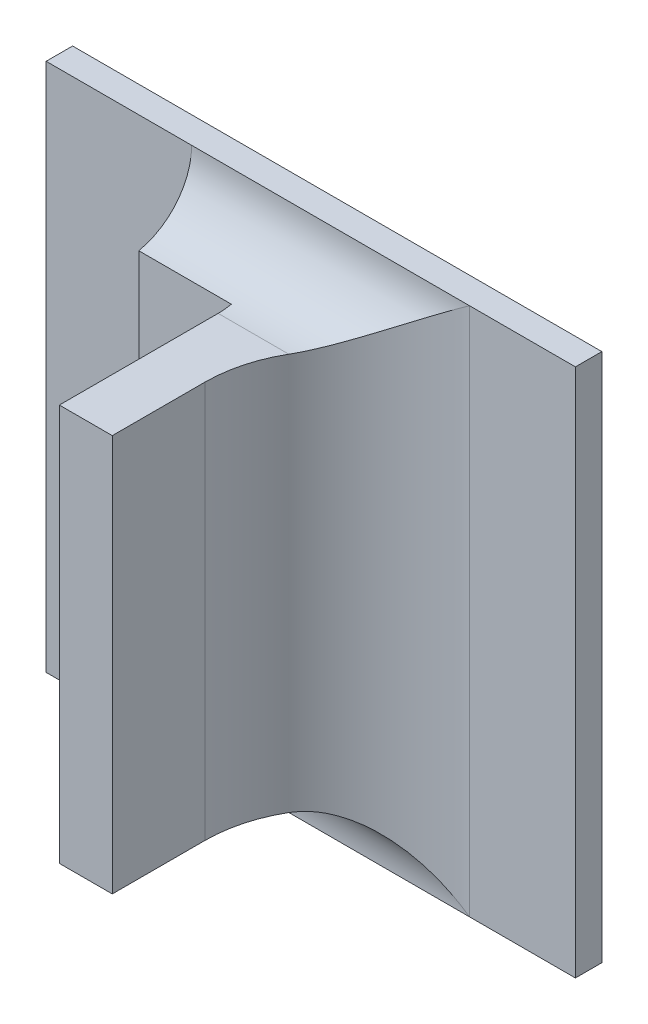
ISO-10303-21;
HEADER;
FILE_DESCRIPTION(('STEP AP214'),'2;1');
FILE_NAME('part.step','',(''),(''),'','','');
FILE_SCHEMA(('AUTOMOTIVE_DESIGN { 1 0 10303 214 1 1 1 1 }'));
ENDSEC;
DATA;
#1=APPLICATION_CONTEXT('core data for automotive mechanical design processes');
#2=APPLICATION_PROTOCOL_DEFINITION('international standard','automotive_design',2000,#1);
#3=PRODUCT_CONTEXT('',#1,'mechanical');
#4=PRODUCT('Part','Part','',(#3));
#5=PRODUCT_RELATED_PRODUCT_CATEGORY('part','',(#4));
#6=PRODUCT_DEFINITION_FORMATION('','',#4);
#7=PRODUCT_DEFINITION_CONTEXT('part definition',#1,'design');
#8=PRODUCT_DEFINITION('design','',#6,#7);
#9=PRODUCT_DEFINITION_SHAPE('','',#8);
#10=(LENGTH_UNIT() NAMED_UNIT(*) SI_UNIT(.MILLI.,.METRE.));
#11=(NAMED_UNIT(*) PLANE_ANGLE_UNIT() SI_UNIT($,.RADIAN.));
#12=(NAMED_UNIT(*) SI_UNIT($,.STERADIAN.) SOLID_ANGLE_UNIT());
#13=UNCERTAINTY_MEASURE_WITH_UNIT(LENGTH_MEASURE(1.E-05),#10,'distance_accuracy_value','');
#14=(GEOMETRIC_REPRESENTATION_CONTEXT(3) GLOBAL_UNCERTAINTY_ASSIGNED_CONTEXT((#13)) GLOBAL_UNIT_ASSIGNED_CONTEXT((#10,
#11,#12)) REPRESENTATION_CONTEXT('',''));
#15=CARTESIAN_POINT('',(0.,0.,0.));
#16=DIRECTION('',(0.,0.,1.));
#17=DIRECTION('',(1.,0.,0.));
#18=AXIS2_PLACEMENT_3D('',#15,#16,#17);
#19=CARTESIAN_POINT('',(0.425658549336287,-0.311549667580545,0.0796271653543306));
#20=DIRECTION('',(-1.,0.,0.));
#21=DIRECTION('',(0.,-1.,0.));
#22=AXIS2_PLACEMENT_3D('',#19,#20,#21);
#23=PLANE('',#22);
#24=DIRECTION('',(0.,-1.,0.));
#25=VECTOR('',#24,1.);
#26=CARTESIAN_POINT('',(0.425658549336287,-0.360053604588419,0.0800681102362204));
#27=LINE('',#26,#25);
#28=CARTESIAN_POINT('',(0.425658549336287,-0.351234706950624,0.0800681102362204));
#29=VERTEX_POINT('',#28);
#30=CARTESIAN_POINT('',(0.425658549336287,-0.313439431360073,0.0800681102362204));
#31=VERTEX_POINT('',#30);
#32=EDGE_CURVE('E116',#29,#31,#27,.F.);
#33=ORIENTED_EDGE('',*,*,#32,.T.);
#34=DIRECTION('',(0.,0.,1.));
#35=VECTOR('',#34,1.);
#36=CARTESIAN_POINT('',(0.425658549336287,-0.313439431360073,0.0730129921259841));
#37=LINE('',#36,#35);
#38=CARTESIAN_POINT('',(0.425658549336287,-0.313439431360073,0.0888870078740156));
#39=VERTEX_POINT('',#38);
#40=EDGE_CURVE('E294',#39,#31,#37,.F.);
#41=ORIENTED_EDGE('',*,*,#40,.F.);
#42=DIRECTION('',(0.,1.,0.));
#43=VECTOR('',#42,1.);
#44=CARTESIAN_POINT('',(0.425658549336287,-0.311549667580545,0.0888870078740156));
#45=LINE('',#44,#43);
#46=CARTESIAN_POINT('',(0.425658549336287,-0.351234706950624,0.0888870078740156));
#47=VERTEX_POINT('',#46);
#48=EDGE_CURVE('E306',#39,#47,#45,.F.);
#49=ORIENTED_EDGE('',*,*,#48,.T.);
#50=DIRECTION('',(0.,0.,1.));
#51=VECTOR('',#50,1.);
#52=CARTESIAN_POINT('',(0.425658549336287,-0.351234706950624,0.0730129921259841));
#53=LINE('',#52,#51);
#54=EDGE_CURVE('E305',#47,#29,#53,.F.);
#55=ORIENTED_EDGE('',*,*,#54,.T.);
#56=EDGE_LOOP('',(#33,#41,#49,#55));
#57=FACE_BOUND('',#56,.T.);
#58=ADVANCED_FACE('F17',(#57),#23,.F.);
#59=CARTESIAN_POINT('',(0.420367210753609,-0.311549667580545,0.0888870078740156));
#60=DIRECTION('',(0.,0.,-1.));
#61=DIRECTION('',(-1.,0.,0.));
#62=AXIS2_PLACEMENT_3D('',#59,#60,#61);
#63=PLANE('',#62);
#64=DIRECTION('',(0.,1.,0.));
#65=VECTOR('',#64,1.);
#66=CARTESIAN_POINT('',(0.420619179257546,-0.35326446766354,0.0888870078740156));
#67=LINE('',#66,#65);
#68=CARTESIAN_POINT('',(0.420619179257546,-0.313439431360073,0.0888870078740156));
#69=VERTEX_POINT('',#68);
#70=CARTESIAN_POINT('',(0.420619179257546,-0.351234706950624,0.0888870078740156));
#71=VERTEX_POINT('',#70);
#72=EDGE_CURVE('E297',#69,#71,#67,.F.);
#73=ORIENTED_EDGE('',*,*,#72,.T.);
#74=DIRECTION('',(-1.,0.,0.));
#75=VECTOR('',#74,1.);
#76=CARTESIAN_POINT('',(0.427682780215358,-0.351234706950624,0.0888870078740156));
#77=LINE('',#76,#75);
#78=EDGE_CURVE('E302',#71,#47,#77,.F.);
#79=ORIENTED_EDGE('',*,*,#78,.T.);
#80=ORIENTED_EDGE('',*,*,#48,.F.);
#81=DIRECTION('',(-1.,0.,0.));
#82=VECTOR('',#81,1.);
#83=CARTESIAN_POINT('',(0.427682780215358,-0.313439431360073,0.0888870078740156));
#84=LINE('',#83,#82);
#85=EDGE_CURVE('E291',#69,#39,#84,.F.);
#86=ORIENTED_EDGE('',*,*,#85,.F.);
#87=EDGE_LOOP('',(#73,#79,#80,#86));
#88=FACE_BOUND('',#87,.T.);
#89=ADVANCED_FACE('F321',(#88),#63,.F.);
#90=CARTESIAN_POINT('',(0.427682780215358,-0.351234706950624,0.0730129921259841));
#91=DIRECTION('',(0.,1.,0.));
#92=DIRECTION('',(-1.,0.,0.));
#93=AXIS2_PLACEMENT_3D('',#90,#91,#92);
#94=PLANE('',#93);
#95=DIRECTION('',(-1.,0.,0.));
#96=VECTOR('',#95,1.);
#97=CARTESIAN_POINT('',(0.385343588706365,-0.351234706950624,0.0737688976377952));
#98=LINE('',#97,#96);
#99=CARTESIAN_POINT('',(0.420619179257546,-0.351234706950624,0.0737688976377952));
#100=VERTEX_POINT('',#99);
#101=CARTESIAN_POINT('',(0.427346418264987,-0.351234706950624,0.0737688976377951));
#102=VERTEX_POINT('',#101);
#103=EDGE_CURVE('E127',#100,#102,#98,.F.);
#104=ORIENTED_EDGE('',*,*,#103,.T.);
#105=CARTESIAN_POINT('',(0.438256974533137,-0.351234706950624,0.0800681102362204));
#106=DIRECTION('',(0.,-1.,0.));
#107=DIRECTION('',(1.,0.,0.));
#108=AXIS2_PLACEMENT_3D('',#105,#106,#107);
#109=CIRCLE('',#108,0.0125984251968504);
#110=EDGE_CURVE('E20',#102,#29,#109,.F.);
#111=ORIENTED_EDGE('',*,*,#110,.T.);
#112=ORIENTED_EDGE('',*,*,#54,.F.);
#113=ORIENTED_EDGE('',*,*,#78,.F.);
#114=DIRECTION('',(0.,0.,1.));
#115=VECTOR('',#114,1.);
#116=CARTESIAN_POINT('',(0.420619179257546,-0.351234706950624,0.0716901574803148));
#117=LINE('',#116,#115);
#118=EDGE_CURVE('E135',#71,#100,#117,.F.);
#119=ORIENTED_EDGE('',*,*,#118,.T.);
#120=EDGE_LOOP('',(#104,#111,#112,#113,#119));
#121=FACE_BOUND('',#120,.T.);
#122=ADVANCED_FACE('F133',(#121),#94,.F.);
#123=CARTESIAN_POINT('',(0.411359336737861,-0.311409670647157,0.0725090551181101));
#124=DIRECTION('',(0.,0.,-1.));
#125=DIRECTION('',(-1.,0.,0.));
#126=AXIS2_PLACEMENT_3D('',#123,#124,#125);
#127=PLANE('',#126);
#128=DIRECTION('',(1.,0.,0.));
#129=VECTOR('',#128,1.);
#130=CARTESIAN_POINT('',(0.439579809178806,-0.313312161420629,0.0725090551181101));
#131=LINE('',#130,#129);
#132=CARTESIAN_POINT('',(0.420619179257546,-0.313312161420629,0.0725090551181101));
#133=VERTEX_POINT('',#132);
#134=CARTESIAN_POINT('',(0.411800281619751,-0.313312161420629,0.0725090551181101));
#135=VERTEX_POINT('',#134);
#136=EDGE_CURVE('E142',#133,#135,#131,.F.);
#137=ORIENTED_EDGE('',*,*,#136,.T.);
#138=DIRECTION('',(0.,1.,0.));
#139=VECTOR('',#138,1.);
#140=CARTESIAN_POINT('',(0.411800281619751,-0.304620533722278,0.0725090551181101));
#141=LINE('',#140,#139);
#142=CARTESIAN_POINT('',(0.411800281619751,-0.351361976890068,0.0725090551181101));
#143=VERTEX_POINT('',#142);
#144=EDGE_CURVE('E146',#135,#143,#141,.F.);
#145=ORIENTED_EDGE('',*,*,#144,.T.);
#146=DIRECTION('',(-1.,0.,0.));
#147=VECTOR('',#146,1.);
#148=CARTESIAN_POINT('',(0.385343588706365,-0.351361976890068,0.0725090551181101));
#149=LINE('',#148,#147);
#150=CARTESIAN_POINT('',(0.420619179257546,-0.351361976890068,0.0725090551181101));
#151=VERTEX_POINT('',#150);
#152=EDGE_CURVE('E138',#143,#151,#149,.F.);
#153=ORIENTED_EDGE('',*,*,#152,.T.);
#154=DIRECTION('',(0.,1.,0.));
#155=VECTOR('',#154,1.);
#156=CARTESIAN_POINT('',(0.420619179257546,-0.35326446766354,0.0725090551181101));
#157=LINE('',#156,#155);
#158=EDGE_CURVE('E324',#151,#133,#157,.T.);
#159=ORIENTED_EDGE('',*,*,#158,.T.);
#160=EDGE_LOOP('',(#137,#145,#153,#159));
#161=FACE_BOUND('',#160,.T.);
#162=ADVANCED_FACE('F193',(#161),#127,.F.);
#163=CARTESIAN_POINT('',(0.438256974533137,-0.360053604588419,0.0800681102362204));
#164=DIRECTION('',(0.,-1.,0.));
#165=DIRECTION('',(1.,0.,0.));
#166=AXIS2_PLACEMENT_3D('',#163,#164,#165);
#167=CYLINDRICAL_SURFACE('',#166,0.0125984251968504);
#168=CARTESIAN_POINT('',(0.427346418264987,-0.351234706950624,0.073768897637795));
#169=CARTESIAN_POINT('',(0.427618902769467,-0.351235264602844,0.0732955457546591));
#170=CARTESIAN_POINT('',(0.42792101489507,-0.351287791933283,0.0728445682080297));
#171=CARTESIAN_POINT('',(0.428566482669071,-0.351472774611581,0.0720003898002664));
#172=CARTESIAN_POINT('',(0.428909215144327,-0.351604122731851,0.0716064807283955));
#173=CARTESIAN_POINT('',(0.429694452269101,-0.351954482138244,0.0708064921171964));
#174=CARTESIAN_POINT('',(0.430143523397404,-0.352185429374069,0.0704123993317733));
#175=CARTESIAN_POINT('',(0.431073449659003,-0.352703528005895,0.0697017381084181));
#176=CARTESIAN_POINT('',(0.431554482929699,-0.352991015612919,0.0693856602556568));
#177=CARTESIAN_POINT('',(0.432735220374202,-0.353727172372372,0.0687164538298325));
#178=CARTESIAN_POINT('',(0.433444497485564,-0.354193928271791,0.0684002761150404));
#179=CARTESIAN_POINT('',(0.434881525200421,-0.355165489292896,0.0679065689436589));
#180=CARTESIAN_POINT('',(0.435609243960198,-0.355670231444697,0.0677288153407497));
#181=CARTESIAN_POINT('',(0.436785206529677,-0.356494415867953,0.0675478835698786));
#182=CARTESIAN_POINT('',(0.437231061313947,-0.356808848945618,0.0675035718032502));
#183=CARTESIAN_POINT('',(0.437870482358516,-0.357260628255393,0.0674741343290926));
#184=CARTESIAN_POINT('',(0.438063733008177,-0.357397277676518,0.0674696949622004));
#185=CARTESIAN_POINT('',(0.438256974533137,-0.357533919549049,0.06746968503937));
#186=B_SPLINE_CURVE_WITH_KNOTS('',3,(#168,#169,#170,#171,#172,#173,#174,#175,#176,#177,#178,
#179,#180,#181,#182,#183,#184,#185),.UNSPECIFIED.,.F.,.F.,(4,2,2,2,2,2,2,2,4),(0.,
0.00162828046163537,0.00323420635682064,0.00514617952943926,0.00706988591555798,
0.00977367423346231,0.012473075225337,0.0141132082090726,0.0148232188039429),.UNSPECIFIED.);
#187=CARTESIAN_POINT('',(0.438256974533137,-0.357533919549049,0.06746968503937));
#188=VERTEX_POINT('',#187);
#189=EDGE_CURVE('E113',#102,#188,#186,.T.);
#190=ORIENTED_EDGE('',*,*,#189,.T.);
#191=DIRECTION('',(0.,1.,0.));
#192=VECTOR('',#191,1.);
#193=CARTESIAN_POINT('',(0.438256974533137,-0.304620533722278,0.06746968503937));
#194=LINE('',#193,#192);
#195=CARTESIAN_POINT('',(0.438256974533137,-0.307140218761648,0.06746968503937));
#196=VERTEX_POINT('',#195);
#197=EDGE_CURVE('E279',#196,#188,#194,.F.);
#198=ORIENTED_EDGE('',*,*,#197,.F.);
#199=CARTESIAN_POINT('',(0.438256974533137,-0.307140218761648,0.06746968503937));
#200=CARTESIAN_POINT('',(0.438256974438822,-0.307140317600168,0.0674696850393615));
#201=CARTESIAN_POINT('',(0.438256964288311,-0.307140416428939,0.0674696850424135));
#202=CARTESIAN_POINT('',(0.438256928445353,-0.307140611354748,0.0674696850532617));
#203=CARTESIAN_POINT('',(0.438256902687308,-0.307140707438454,0.0674696850610781));
#204=CARTESIAN_POINT('',(0.438256838765286,-0.307140897584729,0.0674696850805151));
#205=CARTESIAN_POINT('',(0.438256800347705,-0.30714099156009,0.0674696850922136));
#206=CARTESIAN_POINT('',(0.438256714098717,-0.307141174837888,0.0674696851185221));
#207=CARTESIAN_POINT('',(0.438256666277362,-0.307141264145186,0.067469685133129));
#208=CARTESIAN_POINT('',(0.438256503866366,-0.307141540902339,0.0674696851828237));
#209=CARTESIAN_POINT('',(0.438256376605556,-0.307141720962886,0.0674696852218837));
#210=CARTESIAN_POINT('',(0.438256101772834,-0.307142061590547,0.0674696853066755));
#211=CARTESIAN_POINT('',(0.438255954365684,-0.307142222297702,0.0674696853523532));
#212=CARTESIAN_POINT('',(0.438255427125546,-0.30714275975848,0.0674696855167746));
#213=CARTESIAN_POINT('',(0.438255020933897,-0.307143110950677,0.0674696856452023));
#214=CARTESIAN_POINT('',(0.438254180977937,-0.307143742641604,0.0674696859163221));
#215=CARTESIAN_POINT('',(0.438253748656656,-0.307144025168177,0.0674696860583659));
#216=CARTESIAN_POINT('',(0.438252070479869,-0.307145088805981,0.0674696866214032));
#217=CARTESIAN_POINT('',(0.438250797887275,-0.307145826268706,0.0674696870727233));
#218=CARTESIAN_POINT('',(0.43824832352845,-0.307147133962223,0.0674696882497374));
#219=CARTESIAN_POINT('',(0.438247126754368,-0.307147713460052,0.0674696889448008));
#220=CARTESIAN_POINT('',(0.438239266918325,-0.307151849249196,0.0674696947394657));
#221=CARTESIAN_POINT('',(0.438233316357029,-0.307156609323055,0.067469705198469));
#222=CARTESIAN_POINT('',(0.43821123423804,-0.307173483152928,0.0674697594501571));
#223=CARTESIAN_POINT('',(0.438194589490827,-0.307184696077487,0.0674698297573796));
#224=CARTESIAN_POINT('',(0.438133821746473,-0.307226386954018,0.0674702062030112));
#225=CARTESIAN_POINT('',(0.438090216208394,-0.307257775090299,0.0674707100991553));
#226=CARTESIAN_POINT('',(0.437923848618546,-0.307376764604737,0.0674735003948733));
#227=CARTESIAN_POINT('',(0.437800556430686,-0.307463363679941,0.0674773623702134));
#228=CARTESIAN_POINT('',(0.436760521775255,-0.308194415116372,0.0675251688134003));
#229=CARTESIAN_POINT('',(0.435845966110576,-0.308840824556344,0.0676670910917156));
#230=CARTESIAN_POINT('',(0.434182625513507,-0.309985925569803,0.0681207439021359));
#231=CARTESIAN_POINT('',(0.433430458958543,-0.310491829145844,0.0684021380812103));
#232=CARTESIAN_POINT('',(0.432200546582992,-0.311283401329248,0.069007145077635));
#233=CARTESIAN_POINT('',(0.431713131050863,-0.311587175065945,0.0692872417521839));
#234=CARTESIAN_POINT('',(0.430746062270782,-0.312158547189347,0.0699361732585048));
#235=CARTESIAN_POINT('',(0.430267221251112,-0.312424585539931,0.0703076754457104));
#236=CARTESIAN_POINT('',(0.429469212762975,-0.312823166861075,0.071029025049874));
#237=CARTESIAN_POINT('',(0.429140885650844,-0.31297243520059,0.0713594163896828));
#238=CARTESIAN_POINT('',(0.428516810434649,-0.313215602302386,0.0720638443645076));
#239=CARTESIAN_POINT('',(0.428220814609918,-0.313309950219131,0.0724374961036004));
#240=CARTESIAN_POINT('',(0.427727016994763,-0.313415914374917,0.073141038661769));
#241=CARTESIAN_POINT('',(0.427521660454619,-0.31344076414939,0.0734635869359735));
#242=CARTESIAN_POINT('',(0.427141035293349,-0.313437989894047,0.0741265585439533));
#243=CARTESIAN_POINT('',(0.426965788006156,-0.31341032882348,0.0744669943307327));
#244=CARTESIAN_POINT('',(0.42664914342728,-0.313294679389271,0.0751565544091365));
#245=CARTESIAN_POINT('',(0.426507984609139,-0.313206281764493,0.0755057220621309));
#246=CARTESIAN_POINT('',(0.426263178152904,-0.312965001062621,0.0761947785868875));
#247=CARTESIAN_POINT('',(0.42615950288724,-0.312812165660658,0.0765346741211982));
#248=CARTESIAN_POINT('',(0.425997799174617,-0.312466071945115,0.0771489075153617));
#249=CARTESIAN_POINT('',(0.425935780344855,-0.312279886373216,0.0774262133810268));
#250=CARTESIAN_POINT('',(0.425834972776401,-0.311863410254162,0.0779502251276348));
#251=CARTESIAN_POINT('',(0.42579618395166,-0.311633119870385,0.0781969311219236));
#252=CARTESIAN_POINT('',(0.425736914380721,-0.311139310998908,0.0786471201676947));
#253=CARTESIAN_POINT('',(0.425716118637251,-0.310876460373297,0.078851297275294));
#254=CARTESIAN_POINT('',(0.425686068802665,-0.310321433419959,0.0792159384509799));
#255=CARTESIAN_POINT('',(0.425676816285678,-0.310029253098465,0.0793763965548561));
#256=CARTESIAN_POINT('',(0.425664518241791,-0.309410568564247,0.0796549300095399));
#257=CARTESIAN_POINT('',(0.42566174556578,-0.309083144094315,0.0797709755115423));
#258=CARTESIAN_POINT('',(0.425658812024396,-0.308413669505017,0.0799477574285475));
#259=CARTESIAN_POINT('',(0.42565865145093,-0.308071617755308,0.0800084876612566));
#260=CARTESIAN_POINT('',(0.425658505130257,-0.307374847298271,0.0800736589499428));
#261=CARTESIAN_POINT('',(0.425658523160028,-0.307020013767971,0.0800768798691539));
#262=CARTESIAN_POINT('',(0.425658600569965,-0.306314811859268,0.0800238026376847));
#263=CARTESIAN_POINT('',(0.425658659952903,-0.305964443781737,0.0799675004977201));
#264=CARTESIAN_POINT('',(0.425661183454692,-0.305277507288452,0.0797968199531621));
#265=CARTESIAN_POINT('',(0.425663651714602,-0.304940963676405,0.0796823417014521));
#266=CARTESIAN_POINT('',(0.425675557720901,-0.30429193671443,0.0793985331604369));
#267=CARTESIAN_POINT('',(0.425684995718328,-0.303979454231589,0.0792292008955119));
#268=CARTESIAN_POINT('',(0.425716866101117,-0.303389548026495,0.0788419881994158));
#269=CARTESIAN_POINT('',(0.425739219685528,-0.303111924019511,0.078624407062953));
#270=CARTESIAN_POINT('',(0.425803507677939,-0.302598008180998,0.0781473882147604));
#271=CARTESIAN_POINT('',(0.425845434614652,-0.30236170062595,0.0778879664985857));
#272=CARTESIAN_POINT('',(0.425953027178495,-0.301944772977547,0.0773466142760765));
#273=CARTESIAN_POINT('',(0.426017814639718,-0.301762499248574,0.0770657832005054));
#274=CARTESIAN_POINT('',(0.426175076067539,-0.301447086827108,0.0764850450664437));
#275=CARTESIAN_POINT('',(0.42626754153052,-0.301313933071312,0.0761851438891879));
#276=CARTESIAN_POINT('',(0.426478461134743,-0.301100802250232,0.0755865038391837));
#277=CARTESIAN_POINT('',(0.42659610402998,-0.301019424424718,0.075287973128724));
#278=CARTESIAN_POINT('',(0.42685781902439,-0.300901879920434,0.0746936193238615));
#279=CARTESIAN_POINT('',(0.427001904997203,-0.300865737052864,0.0743977977367695));
#280=CARTESIAN_POINT('',(0.427324014993842,-0.300833457265666,0.0737980252798641));
#281=CARTESIAN_POINT('',(0.427503635767308,-0.300840072083108,0.0734947949351432));
#282=CARTESIAN_POINT('',(0.427885466549418,-0.300893220663338,0.0729074487273722));
#283=CARTESIAN_POINT('',(0.428087655394361,-0.300939717295166,0.0726233153498298));
#284=CARTESIAN_POINT('',(0.428622364090683,-0.301099160254376,0.0719334846819081));
#285=CARTESIAN_POINT('',(0.428967440682686,-0.301234206619572,0.0715425793781451));
#286=CARTESIAN_POINT('',(0.429692118241114,-0.30156235973977,0.0708143812686401));
#287=CARTESIAN_POINT('',(0.430072057118797,-0.301756088608605,0.0704777252629505));
#288=CARTESIAN_POINT('',(0.431026722998603,-0.302279339643324,0.0697260645086062));
#289=CARTESIAN_POINT('',(0.431613503812273,-0.302631080843893,0.0693419139325726));
#290=CARTESIAN_POINT('',(0.432788385858753,-0.303370485460523,0.0686995101782901));
#291=CARTESIAN_POINT('',(0.433375398593854,-0.303756022313255,0.0684366507296655));
#292=CARTESIAN_POINT('',(0.434524288565559,-0.304528568289244,0.0680209366897774));
#293=CARTESIAN_POINT('',(0.435085209036768,-0.304913742395932,0.0678618837368312));
#294=CARTESIAN_POINT('',(0.436321603106594,-0.305774456157341,0.0676002423539604));
#295=CARTESIAN_POINT('',(0.436998493798785,-0.306253204314874,0.0675142406050075));
#296=CARTESIAN_POINT('',(0.437800034589787,-0.306816723517622,0.0674773844657497));
#297=CARTESIAN_POINT('',(0.43792282744822,-0.306902958808099,0.0674735321464732));
#298=CARTESIAN_POINT('',(0.43808904884134,-0.307021838644933,0.0674707243957126));
#299=CARTESIAN_POINT('',(0.43813300992244,-0.307053485081974,0.0674702128513251));
#300=CARTESIAN_POINT('',(0.438194255542905,-0.307095501849072,0.0674698312735403));
#301=CARTESIAN_POINT('',(0.438211017064816,-0.307106792621677,0.0674697601164234));
#302=CARTESIAN_POINT('',(0.438233237836947,-0.307123774563247,0.0674697053274289));
#303=CARTESIAN_POINT('',(0.438239214791401,-0.307128556132832,0.0674696947878421));
#304=CARTESIAN_POINT('',(0.438247108811657,-0.307132705901441,0.0674696889590613));
#305=CARTESIAN_POINT('',(0.438248308763518,-0.307133286333551,0.0674696882612312));
#306=CARTESIAN_POINT('',(0.438250789596883,-0.307134597075485,0.0674696870796236));
#307=CARTESIAN_POINT('',(0.438252065424562,-0.307135336773202,0.0674696866266876));
#308=CARTESIAN_POINT('',(0.438253747260274,-0.307136403621154,0.0674696860616838));
#309=CARTESIAN_POINT('',(0.438254180219584,-0.307136686826689,0.0674696859192267));
#310=CARTESIAN_POINT('',(0.438255021293022,-0.307137320138761,0.0674696856472792));
#311=CARTESIAN_POINT('',(0.438255427954509,-0.307137672284289,0.0674696855184389));
#312=CARTESIAN_POINT('',(0.43825595560389,-0.30713821114919,0.0674696853534853));
#313=CARTESIAN_POINT('',(0.43825610307399,-0.307138372237131,0.067469685307667));
#314=CARTESIAN_POINT('',(0.438256377953441,-0.307138713663398,0.0674696852226042));
#315=CARTESIAN_POINT('',(0.438256505197113,-0.30713889414225,0.0674696851834138));
#316=CARTESIAN_POINT('',(0.438256667493891,-0.307139171508259,0.0674696851335454));
#317=CARTESIAN_POINT('',(0.438256715263801,-0.307139261001292,0.067469685118887));
#318=CARTESIAN_POINT('',(0.438256801379348,-0.30713944464998,0.0674696850924812));
#319=CARTESIAN_POINT('',(0.438256839714873,-0.307139538810509,0.067469685080737));
#320=CARTESIAN_POINT('',(0.438256903435913,-0.307139729312035,0.067469685061218));
#321=CARTESIAN_POINT('',(0.438256929076262,-0.307139825565832,0.0674696850533652));
#322=CARTESIAN_POINT('',(0.438256964639104,-0.307140020812425,0.0674696850424555));
#323=CARTESIAN_POINT('',(0.438256974627577,-0.307140119791924,0.0674696850393785));
#324=CARTESIAN_POINT('',(0.438256974533137,-0.307140218761648,0.06746968503937));
#325=B_SPLINE_CURVE_WITH_KNOTS('',3,(#199,#200,#201,#202,#203,#204,#205,#206,#207,#208,#209,
#210,#211,#212,#213,#214,#215,#216,#217,#218,#219,#220,#221,#222,#223,#224,#225,#226,#227,#228,
#229,#230,#231,#232,#233,#234,#235,#236,#237,#238,#239,#240,#241,#242,#243,#244,#245,#246,#247,
#248,#249,#250,#251,#252,#253,#254,#255,#256,#257,#258,#259,#260,#261,#262,#263,#264,#265,#266,
#267,#268,#269,#270,#271,#272,#273,#274,#275,#276,#277,#278,#279,#280,#281,#282,#283,#284,#285,
#286,#287,#288,#289,#290,#291,#292,#293,#294,#295,#296,#297,#298,#299,#300,#301,#302,#303,#304,
#305,#306,#307,#308,#309,#310,#311,#312,#313,#314,#315,#316,#317,#318,#319,#320,#321,#322,#323,
#324),.UNSPECIFIED.,.T.,.F.,(4,2,2,2,2,2,2,2,2,2,2,2,2,2,2,2,2,2,2,2,2,2,2,2,2,2,2,2,2,2,2,2,2,
2,2,2,2,2,2,2,2,2,2,2,2,2,2,2,2,2,2,2,2,2,2,2,2,2,2,2,2,2,4),(0.,2.96262718477316E-07,
5.93779356058444E-07,8.97660571573596E-07,1.20121869984068E-06,1.85983939929508E-06,
2.51336440040741E-06,4.11695718381811E-06,5.6649867523353E-06,1.00742722995031E-05,
1.40586629767685E-05,3.67471450073604E-05,9.70745534321224E-05,0.000258117828158611,
0.000710418104869183,0.00407475533961822,0.00690809627288586,0.00881968522125092,
0.0107955574621808,0.0122580167053817,0.0137083411294308,0.0148534027078703,0.0159992723041917,
0.017152939826701,0.0183057552869513,0.0193199166517909,0.0203340742599355,0.0213300957694083,
0.0223262530896368,0.0233636546164694,0.0244011720739371,0.0254606762934847,0.0265202515263764,
0.0275816514712125,0.0286430896476358,0.0296981191234645,0.0307527462159097,0.031770621479094,
0.032788184337071,0.0337768943877516,0.0347661246662932,0.0358196249691739,0.0368721455004047,
0.0384790134244906,0.0401035507750212,0.0424440092075655,0.0446862628276774,0.0467780451238266,
0.0492693497424132,0.049719781732113,0.0498821419378972,0.0499428919104111,0.0499656810460577,
0.0499696752051923,0.0499740961721065,0.049975646909701,0.049977253393487,0.0499779078855006,
0.049978567489383,0.0499788714648539,0.0499791757647538,0.0499794736800123,0.0499797703360083),.UNSPECIFIED.);
#326=CARTESIAN_POINT('',(0.427346418264987,-0.313439431360073,0.0737688976377952));
#327=VERTEX_POINT('',#326);
#328=EDGE_CURVE('E197',#196,#327,#325,.T.);
#329=ORIENTED_EDGE('',*,*,#328,.T.);
#330=CARTESIAN_POINT('',(0.438256974533137,-0.313439431360073,0.0800681102362204));
#331=DIRECTION('',(0.,1.,0.));
#332=DIRECTION('',(-1.,0.,0.));
#333=AXIS2_PLACEMENT_3D('',#330,#331,#332);
#334=CIRCLE('',#333,0.0125984251968504);
#335=EDGE_CURVE('E121',#31,#327,#334,.F.);
#336=ORIENTED_EDGE('',*,*,#335,.F.);
#337=ORIENTED_EDGE('',*,*,#32,.F.);
#338=ORIENTED_EDGE('',*,*,#110,.F.);
#339=EDGE_LOOP('',(#190,#198,#329,#336,#337,#338));
#340=FACE_BOUND('',#339,.T.);
#341=ADVANCED_FACE('F111',(#340),#167,.F.);
#342=CARTESIAN_POINT('',(0.427682780215358,-0.313439431360073,0.0730129921259841));
#343=DIRECTION('',(0.,1.,0.));
#344=DIRECTION('',(-1.,0.,0.));
#345=AXIS2_PLACEMENT_3D('',#342,#343,#344);
#346=PLANE('',#345);
#347=ORIENTED_EDGE('',*,*,#85,.T.);
#348=ORIENTED_EDGE('',*,*,#40,.T.);
#349=ORIENTED_EDGE('',*,*,#335,.T.);
#350=DIRECTION('',(1.,0.,0.));
#351=VECTOR('',#350,1.);
#352=CARTESIAN_POINT('',(0.439579809178806,-0.313439431360073,0.0737688976377952));
#353=LINE('',#352,#351);
#354=CARTESIAN_POINT('',(0.420619179257546,-0.313439431360073,0.0737688976377952));
#355=VERTEX_POINT('',#354);
#356=EDGE_CURVE('E266',#327,#355,#353,.F.);
#357=ORIENTED_EDGE('',*,*,#356,.T.);
#358=DIRECTION('',(0.,0.,1.));
#359=VECTOR('',#358,1.);
#360=CARTESIAN_POINT('',(0.420619179257546,-0.313439431360073,0.0716901574803148));
#361=LINE('',#360,#359);
#362=EDGE_CURVE('E149',#355,#69,#361,.T.);
#363=ORIENTED_EDGE('',*,*,#362,.T.);
#364=EDGE_LOOP('',(#347,#348,#349,#357,#363));
#365=FACE_BOUND('',#364,.T.);
#366=ADVANCED_FACE('F183',(#365),#346,.T.);
#367=CARTESIAN_POINT('',(0.420619179257546,-0.35326446766354,0.0716901574803148));
#368=DIRECTION('',(1.,0.,0.));
#369=DIRECTION('',(0.,1.,0.));
#370=AXIS2_PLACEMENT_3D('',#367,#368,#369);
#371=PLANE('',#370);
#372=CARTESIAN_POINT('',(0.420619179257546,-0.313312161420629,0.0725090551181101));
#373=CARTESIAN_POINT('',(0.420619179257546,-0.313439431360073,0.0731325479405746));
#374=CARTESIAN_POINT('',(0.420619179257546,-0.313439431360073,0.0737688976377952));
#375=B_SPLINE_CURVE_WITH_KNOTS('',2,(#372,#373,#374),.UNSPECIFIED.,.F.,.F.,(3,3),(0.,1.),.UNSPECIFIED.);
#376=EDGE_CURVE('E153',#355,#133,#375,.F.);
#377=ORIENTED_EDGE('',*,*,#376,.T.);
#378=ORIENTED_EDGE('',*,*,#158,.F.);
#379=CARTESIAN_POINT('',(0.420619179257546,-0.351234706950624,0.0737688976377952));
#380=CARTESIAN_POINT('',(0.420619179257546,-0.351234706950624,0.0731325479405747));
#381=CARTESIAN_POINT('',(0.420619179257546,-0.351361976890068,0.0725090551181101));
#382=B_SPLINE_CURVE_WITH_KNOTS('',2,(#379,#380,#381),.UNSPECIFIED.,.F.,.F.,(3,3),(0.,1.),.UNSPECIFIED.);
#383=EDGE_CURVE('E136',#151,#100,#382,.F.);
#384=ORIENTED_EDGE('',*,*,#383,.T.);
#385=ORIENTED_EDGE('',*,*,#118,.F.);
#386=ORIENTED_EDGE('',*,*,#72,.F.);
#387=ORIENTED_EDGE('',*,*,#362,.F.);
#388=EDGE_LOOP('',(#377,#378,#384,#385,#386,#387));
#389=FACE_BOUND('',#388,.T.);
#390=ADVANCED_FACE('F172',(#389),#371,.F.);
#391=CARTESIAN_POINT('',(0.411800281619751,-0.304620533722278,0.067217716535433));
#392=DIRECTION('',(1.,0.,0.));
#393=DIRECTION('',(0.,1.,0.));
#394=AXIS2_PLACEMENT_3D('',#391,#392,#393);
#395=PLANE('',#394);
#396=CARTESIAN_POINT('',(0.411800281619751,-0.307140218761648,0.0737688976377952));
#397=DIRECTION('',(1.,0.,0.));
#398=DIRECTION('',(0.,1.,0.));
#399=AXIS2_PLACEMENT_3D('',#396,#397,#398);
#400=CIRCLE('',#399,0.0062992125984252);
#401=CARTESIAN_POINT('',(0.411800281619751,-0.307140218761648,0.06746968503937));
#402=VERTEX_POINT('',#401);
#403=EDGE_CURVE('E272',#135,#402,#400,.T.);
#404=ORIENTED_EDGE('',*,*,#403,.T.);
#405=DIRECTION('',(0.,1.,0.));
#406=VECTOR('',#405,1.);
#407=CARTESIAN_POINT('',(0.411800281619751,-0.304620533722278,0.06746968503937));
#408=LINE('',#407,#406);
#409=CARTESIAN_POINT('',(0.411800281619751,-0.357533919549049,0.06746968503937));
#410=VERTEX_POINT('',#409);
#411=EDGE_CURVE('E150',#410,#402,#408,.T.);
#412=ORIENTED_EDGE('',*,*,#411,.F.);
#413=CARTESIAN_POINT('',(0.411800281619751,-0.357533919549049,0.0737688976377952));
#414=DIRECTION('',(-1.,0.,0.));
#415=DIRECTION('',(0.,-1.,0.));
#416=AXIS2_PLACEMENT_3D('',#413,#414,#415);
#417=CIRCLE('',#416,0.0062992125984252);
#418=EDGE_CURVE('E131',#410,#143,#417,.F.);
#419=ORIENTED_EDGE('',*,*,#418,.T.);
#420=ORIENTED_EDGE('',*,*,#144,.F.);
#421=EDGE_LOOP('',(#404,#412,#419,#420));
#422=FACE_BOUND('',#421,.T.);
#423=ADVANCED_FACE('F182',(#422),#395,.F.);
#424=CARTESIAN_POINT('',(0.385343588706365,-0.357533919549049,0.0737688976377952));
#425=DIRECTION('',(-1.,0.,0.));
#426=DIRECTION('',(0.,-1.,0.));
#427=AXIS2_PLACEMENT_3D('',#424,#425,#426);
#428=CYLINDRICAL_SURFACE('',#427,0.0062992125984252);
#429=DIRECTION('',(-1.,0.,0.));
#430=VECTOR('',#429,1.);
#431=CARTESIAN_POINT('',(0.450855399729987,-0.357533919549049,0.06746968503937));
#432=LINE('',#431,#430);
#433=EDGE_CURVE('E130',#410,#188,#432,.F.);
#434=ORIENTED_EDGE('',*,*,#433,.T.);
#435=ORIENTED_EDGE('',*,*,#189,.F.);
#436=ORIENTED_EDGE('',*,*,#103,.F.);
#437=ORIENTED_EDGE('',*,*,#383,.F.);
#438=ORIENTED_EDGE('',*,*,#152,.F.);
#439=ORIENTED_EDGE('',*,*,#418,.F.);
#440=EDGE_LOOP('',(#434,#435,#436,#437,#438,#439));
#441=FACE_BOUND('',#440,.T.);
#442=ADVANCED_FACE('F125',(#441),#428,.F.);
#443=CARTESIAN_POINT('',(0.448839651698491,-0.304620533722278,0.06746968503937));
#444=DIRECTION('',(0.,0.,1.));
#445=DIRECTION('',(1.,0.,0.));
#446=AXIS2_PLACEMENT_3D('',#443,#444,#445);
#447=PLANE('',#446);
#448=DIRECTION('',(0.,-1.,0.));
#449=VECTOR('',#448,1.);
#450=CARTESIAN_POINT('',(0.448335714690617,-0.304620533722278,0.06746968503937));
#451=LINE('',#450,#449);
#452=CARTESIAN_POINT('',(0.448335714690617,-0.357533919549049,0.06746968503937));
#453=VERTEX_POINT('',#452);
#454=CARTESIAN_POINT('',(0.448335714690617,-0.307140218761648,0.06746968503937));
#455=VERTEX_POINT('',#454);
#456=EDGE_CURVE('E262',#453,#455,#451,.F.);
#457=ORIENTED_EDGE('',*,*,#456,.T.);
#458=DIRECTION('',(1.,0.,0.));
#459=VECTOR('',#458,1.);
#460=CARTESIAN_POINT('',(0.395422328863845,-0.307140218761648,0.06746968503937));
#461=LINE('',#460,#459);
#462=EDGE_CURVE('E166',#455,#196,#461,.F.);
#463=ORIENTED_EDGE('',*,*,#462,.T.);
#464=ORIENTED_EDGE('',*,*,#197,.T.);
#465=DIRECTION('',(-1.,0.,0.));
#466=VECTOR('',#465,1.);
#467=CARTESIAN_POINT('',(0.450855399729987,-0.357533919549049,0.06746968503937));
#468=LINE('',#467,#466);
#469=EDGE_CURVE('E155',#188,#453,#468,.F.);
#470=ORIENTED_EDGE('',*,*,#469,.T.);
#471=EDGE_LOOP('',(#457,#463,#464,#470));
#472=FACE_BOUND('',#471,.T.);
#473=ADVANCED_FACE('F211',(#472),#447,.T.);
#474=CARTESIAN_POINT('',(0.439579809178806,-0.307140218761648,0.0737688976377952));
#475=DIRECTION('',(1.,0.,0.));
#476=DIRECTION('',(0.,1.,0.));
#477=AXIS2_PLACEMENT_3D('',#474,#475,#476);
#478=CYLINDRICAL_SURFACE('',#477,0.0062992125984252);
#479=ORIENTED_EDGE('',*,*,#356,.F.);
#480=ORIENTED_EDGE('',*,*,#328,.F.);
#481=DIRECTION('',(1.,0.,0.));
#482=VECTOR('',#481,1.);
#483=CARTESIAN_POINT('',(0.395422328863845,-0.307140218761648,0.06746968503937));
#484=LINE('',#483,#482);
#485=EDGE_CURVE('E164',#196,#402,#484,.F.);
#486=ORIENTED_EDGE('',*,*,#485,.T.);
#487=ORIENTED_EDGE('',*,*,#403,.F.);
#488=ORIENTED_EDGE('',*,*,#136,.F.);
#489=ORIENTED_EDGE('',*,*,#376,.F.);
#490=EDGE_LOOP('',(#479,#480,#486,#487,#488,#489));
#491=FACE_BOUND('',#490,.T.);
#492=ADVANCED_FACE('F213',(#491),#478,.F.);
#493=CARTESIAN_POINT('',(0.412493195005578,-0.304620533722278,0.06746968503937));
#494=DIRECTION('',(0.,0.,1.));
#495=DIRECTION('',(1.,0.,0.));
#496=AXIS2_PLACEMENT_3D('',#493,#494,#495);
#497=PLANE('',#496);
#498=DIRECTION('',(1.,0.,0.));
#499=VECTOR('',#498,1.);
#500=CARTESIAN_POINT('',(0.395422328863845,-0.307140218761648,0.06746968503937));
#501=LINE('',#500,#499);
#502=CARTESIAN_POINT('',(0.397942013903215,-0.307140218761648,0.06746968503937));
#503=VERTEX_POINT('',#502);
#504=EDGE_CURVE('E160',#402,#503,#501,.F.);
#505=ORIENTED_EDGE('',*,*,#504,.T.);
#506=DIRECTION('',(0.,1.,0.));
#507=VECTOR('',#506,1.);
#508=CARTESIAN_POINT('',(0.397942013903215,-0.360053604588419,0.06746968503937));
#509=LINE('',#508,#507);
#510=CARTESIAN_POINT('',(0.397942013903215,-0.357533919549049,0.06746968503937));
#511=VERTEX_POINT('',#510);
#512=EDGE_CURVE('E152',#503,#511,#509,.F.);
#513=ORIENTED_EDGE('',*,*,#512,.T.);
#514=DIRECTION('',(-1.,0.,0.));
#515=VECTOR('',#514,1.);
#516=CARTESIAN_POINT('',(0.450855399729987,-0.357533919549049,0.06746968503937));
#517=LINE('',#516,#515);
#518=EDGE_CURVE('E156',#511,#410,#517,.F.);
#519=ORIENTED_EDGE('',*,*,#518,.T.);
#520=ORIENTED_EDGE('',*,*,#411,.T.);
#521=EDGE_LOOP('',(#505,#513,#519,#520));
#522=FACE_BOUND('',#521,.T.);
#523=ADVANCED_FACE('F218',(#522),#497,.T.);
#524=CARTESIAN_POINT('',(0.397942013903215,-0.360053604588419,0.0648240157480314));
#525=DIRECTION('',(1.,0.,0.));
#526=DIRECTION('',(0.,1.,0.));
#527=AXIS2_PLACEMENT_3D('',#524,#525,#526);
#528=PLANE('',#527);
#529=DIRECTION('',(0.,0.,1.));
#530=VECTOR('',#529,1.);
#531=CARTESIAN_POINT('',(0.397942013903215,-0.357533919549049,0.0648240157480314));
#532=LINE('',#531,#530);
#533=CARTESIAN_POINT('',(0.397942013903215,-0.357533919549049,0.0649499999999999));
#534=VERTEX_POINT('',#533);
#535=EDGE_CURVE('E159',#534,#511,#532,.T.);
#536=ORIENTED_EDGE('',*,*,#535,.T.);
#537=ORIENTED_EDGE('',*,*,#512,.F.);
#538=DIRECTION('',(0.,0.,1.));
#539=VECTOR('',#538,1.);
#540=CARTESIAN_POINT('',(0.397942013903215,-0.307140218761648,0.0648240157480314));
#541=LINE('',#540,#539);
#542=CARTESIAN_POINT('',(0.397942013903215,-0.307140218761648,0.0649499999999999));
#543=VERTEX_POINT('',#542);
#544=EDGE_CURVE('E163',#503,#543,#541,.F.);
#545=ORIENTED_EDGE('',*,*,#544,.T.);
#546=DIRECTION('',(0.,1.,0.));
#547=VECTOR('',#546,1.);
#548=CARTESIAN_POINT('',(0.397942013903215,-0.304620533722278,0.0649499999999999));
#549=LINE('',#548,#547);
#550=EDGE_CURVE('E255',#543,#534,#549,.F.);
#551=ORIENTED_EDGE('',*,*,#550,.T.);
#552=EDGE_LOOP('',(#536,#537,#545,#551));
#553=FACE_BOUND('',#552,.T.);
#554=ADVANCED_FACE('F222',(#553),#528,.F.);
#555=CARTESIAN_POINT('',(0.450855399729987,-0.357533919549049,0.0648240157480314));
#556=DIRECTION('',(0.,1.,0.));
#557=DIRECTION('',(-1.,0.,0.));
#558=AXIS2_PLACEMENT_3D('',#555,#556,#557);
#559=PLANE('',#558);
#560=DIRECTION('',(0.,0.,1.));
#561=VECTOR('',#560,1.);
#562=CARTESIAN_POINT('',(0.448335714690617,-0.357533919549049,0.0648240157480314));
#563=LINE('',#562,#561);
#564=CARTESIAN_POINT('',(0.448335714690617,-0.357533919549049,0.0649499999999999));
#565=VERTEX_POINT('',#564);
#566=EDGE_CURVE('E252',#565,#453,#563,.T.);
#567=ORIENTED_EDGE('',*,*,#566,.T.);
#568=ORIENTED_EDGE('',*,*,#469,.F.);
#569=ORIENTED_EDGE('',*,*,#433,.F.);
#570=ORIENTED_EDGE('',*,*,#518,.F.);
#571=ORIENTED_EDGE('',*,*,#535,.F.);
#572=DIRECTION('',(1.,0.,0.));
#573=VECTOR('',#572,1.);
#574=CARTESIAN_POINT('',(0.450855399729987,-0.357533919549049,0.0649499999999999));
#575=LINE('',#574,#573);
#576=EDGE_CURVE('E248',#534,#565,#575,.T.);
#577=ORIENTED_EDGE('',*,*,#576,.T.);
#578=EDGE_LOOP('',(#567,#568,#569,#570,#571,#577));
#579=FACE_BOUND('',#578,.T.);
#580=ADVANCED_FACE('F226',(#579),#559,.F.);
#581=CARTESIAN_POINT('',(0.448335714690617,-0.304620533722278,0.0648240157480314));
#582=DIRECTION('',(-1.,0.,0.));
#583=DIRECTION('',(0.,-1.,0.));
#584=AXIS2_PLACEMENT_3D('',#581,#582,#583);
#585=PLANE('',#584);
#586=DIRECTION('',(0.,0.,1.));
#587=VECTOR('',#586,1.);
#588=CARTESIAN_POINT('',(0.448335714690617,-0.307140218761648,0.0648240157480314));
#589=LINE('',#588,#587);
#590=CARTESIAN_POINT('',(0.448335714690617,-0.307140218761648,0.0649499999999999));
#591=VERTEX_POINT('',#590);
#592=EDGE_CURVE('E34',#591,#455,#589,.T.);
#593=ORIENTED_EDGE('',*,*,#592,.T.);
#594=ORIENTED_EDGE('',*,*,#456,.F.);
#595=ORIENTED_EDGE('',*,*,#566,.F.);
#596=DIRECTION('',(0.,1.,0.));
#597=VECTOR('',#596,1.);
#598=CARTESIAN_POINT('',(0.448335714690617,-0.304620533722278,0.0649499999999999));
#599=LINE('',#598,#597);
#600=EDGE_CURVE('E26',#565,#591,#599,.T.);
#601=ORIENTED_EDGE('',*,*,#600,.T.);
#602=EDGE_LOOP('',(#593,#594,#595,#601));
#603=FACE_BOUND('',#602,.T.);
#604=ADVANCED_FACE('F230',(#603),#585,.F.);
#605=CARTESIAN_POINT('',(0.395422328863845,-0.307140218761648,0.0648240157480314));
#606=DIRECTION('',(0.,-1.,0.));
#607=DIRECTION('',(1.,0.,0.));
#608=AXIS2_PLACEMENT_3D('',#605,#606,#607);
#609=PLANE('',#608);
#610=ORIENTED_EDGE('',*,*,#544,.F.);
#611=ORIENTED_EDGE('',*,*,#504,.F.);
#612=ORIENTED_EDGE('',*,*,#485,.F.);
#613=ORIENTED_EDGE('',*,*,#462,.F.);
#614=ORIENTED_EDGE('',*,*,#592,.F.);
#615=DIRECTION('',(1.,0.,0.));
#616=VECTOR('',#615,1.);
#617=CARTESIAN_POINT('',(0.450855399729987,-0.307140218761648,0.0649499999999999));
#618=LINE('',#617,#616);
#619=EDGE_CURVE('E11',#591,#543,#618,.F.);
#620=ORIENTED_EDGE('',*,*,#619,.T.);
#621=EDGE_LOOP('',(#610,#611,#612,#613,#614,#620));
#622=FACE_BOUND('',#621,.T.);
#623=ADVANCED_FACE('F234',(#622),#609,.F.);
#624=CARTESIAN_POINT('',(0.450855399729987,-0.304620533722278,0.0649499999999999));
#625=DIRECTION('',(0.,0.,1.));
#626=DIRECTION('',(1.,0.,0.));
#627=AXIS2_PLACEMENT_3D('',#624,#625,#626);
#628=PLANE('',#627);
#629=ORIENTED_EDGE('',*,*,#600,.F.);
#630=ORIENTED_EDGE('',*,*,#576,.F.);
#631=ORIENTED_EDGE('',*,*,#550,.F.);
#632=ORIENTED_EDGE('',*,*,#619,.F.);
#633=EDGE_LOOP('',(#629,#630,#631,#632));
#634=FACE_BOUND('',#633,.T.);
#635=ADVANCED_FACE('F238',(#634),#628,.F.);
#636=CLOSED_SHELL('',(#58,#89,#122,#162,#341,#366,#390,#423,#442,#473,#492,#523,#554,#580,#604,
#623,#635));
#637=MANIFOLD_SOLID_BREP('B1',#636);
#638=ADVANCED_BREP_SHAPE_REPRESENTATION('',(#18,#637),#14);
#639=SHAPE_DEFINITION_REPRESENTATION(#9,#638);
ENDSEC;
END-ISO-10303-21;
